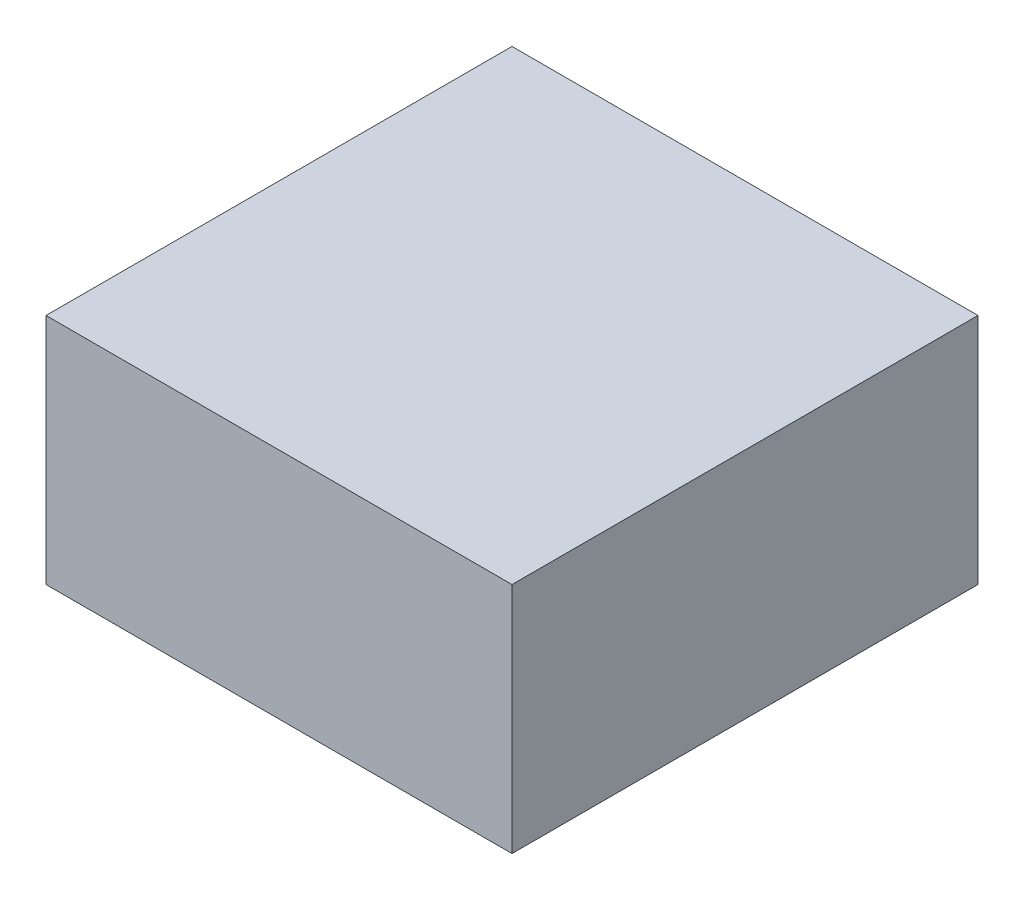
ISO-10303-21;
HEADER;
FILE_DESCRIPTION(('STEP AP214'),'2;1');
FILE_NAME('part.step','',(''),(''),'','','');
FILE_SCHEMA(('AUTOMOTIVE_DESIGN { 1 0 10303 214 1 1 1 1 }'));
ENDSEC;
DATA;
#1=APPLICATION_CONTEXT('core data for automotive mechanical design processes');
#2=APPLICATION_PROTOCOL_DEFINITION('international standard','automotive_design',2000,#1);
#3=PRODUCT_CONTEXT('',#1,'mechanical');
#4=PRODUCT('Part','Part','',(#3));
#5=PRODUCT_RELATED_PRODUCT_CATEGORY('part','',(#4));
#6=PRODUCT_DEFINITION_FORMATION('','',#4);
#7=PRODUCT_DEFINITION_CONTEXT('part definition',#1,'design');
#8=PRODUCT_DEFINITION('design','',#6,#7);
#9=PRODUCT_DEFINITION_SHAPE('','',#8);
#10=(LENGTH_UNIT() NAMED_UNIT(*) SI_UNIT(.MILLI.,.METRE.));
#11=(NAMED_UNIT(*) PLANE_ANGLE_UNIT() SI_UNIT($,.RADIAN.));
#12=(NAMED_UNIT(*) SI_UNIT($,.STERADIAN.) SOLID_ANGLE_UNIT());
#13=UNCERTAINTY_MEASURE_WITH_UNIT(LENGTH_MEASURE(1.E-05),#10,'distance_accuracy_value','');
#14=(GEOMETRIC_REPRESENTATION_CONTEXT(3) GLOBAL_UNCERTAINTY_ASSIGNED_CONTEXT((#13)) GLOBAL_UNIT_ASSIGNED_CONTEXT((#10,
#11,#12)) REPRESENTATION_CONTEXT('',''));
#15=CARTESIAN_POINT('',(0.,0.,0.));
#16=DIRECTION('',(0.,0.,1.));
#17=DIRECTION('',(1.,0.,0.));
#18=AXIS2_PLACEMENT_3D('',#15,#16,#17);
#19=CARTESIAN_POINT('',(0.1,0.1,-0.1));
#20=DIRECTION('',(-1.,0.,0.));
#21=DIRECTION('',(0.,0.,1.));
#22=AXIS2_PLACEMENT_3D('',#19,#20,#21);
#23=PLANE('',#22);
#24=DIRECTION('',(0.,0.,-1.));
#25=VECTOR('',#24,1.);
#26=CARTESIAN_POINT('',(0.1,0.,-0.1));
#27=LINE('',#26,#25);
#28=CARTESIAN_POINT('',(0.1,0.,0.1));
#29=VERTEX_POINT('',#28);
#30=CARTESIAN_POINT('',(0.1,0.,-0.1));
#31=VERTEX_POINT('',#30);
#32=EDGE_CURVE('E96',#29,#31,#27,.T.);
#33=ORIENTED_EDGE('',*,*,#32,.T.);
#34=DIRECTION('',(0.,-1.,0.));
#35=VECTOR('',#34,1.);
#36=CARTESIAN_POINT('',(0.1,0.1,-0.1));
#37=LINE('',#36,#35);
#38=CARTESIAN_POINT('',(0.1,0.1,-0.1));
#39=VERTEX_POINT('',#38);
#40=EDGE_CURVE('E11',#39,#31,#37,.T.);
#41=ORIENTED_EDGE('',*,*,#40,.F.);
#42=DIRECTION('',(0.,0.,-1.));
#43=VECTOR('',#42,1.);
#44=CARTESIAN_POINT('',(0.1,0.1,-0.1));
#45=LINE('',#44,#43);
#46=CARTESIAN_POINT('',(0.1,0.1,0.1));
#47=VERTEX_POINT('',#46);
#48=EDGE_CURVE('E84',#47,#39,#45,.T.);
#49=ORIENTED_EDGE('',*,*,#48,.F.);
#50=DIRECTION('',(0.,-1.,0.));
#51=VECTOR('',#50,1.);
#52=CARTESIAN_POINT('',(0.1,0.1,0.1));
#53=LINE('',#52,#51);
#54=EDGE_CURVE('E92',#47,#29,#53,.T.);
#55=ORIENTED_EDGE('',*,*,#54,.T.);
#56=EDGE_LOOP('',(#33,#41,#49,#55));
#57=FACE_BOUND('',#56,.T.);
#58=ADVANCED_FACE('F33',(#57),#23,.F.);
#59=CARTESIAN_POINT('',(0.1,0.1,-0.1));
#60=DIRECTION('',(0.,0.,1.));
#61=DIRECTION('',(1.,0.,0.));
#62=AXIS2_PLACEMENT_3D('',#59,#60,#61);
#63=PLANE('',#62);
#64=DIRECTION('',(-1.,0.,0.));
#65=VECTOR('',#64,1.);
#66=CARTESIAN_POINT('',(0.1,0.,-0.1));
#67=LINE('',#66,#65);
#68=CARTESIAN_POINT('',(-0.1,0.,-0.1));
#69=VERTEX_POINT('',#68);
#70=EDGE_CURVE('E88',#31,#69,#67,.T.);
#71=ORIENTED_EDGE('',*,*,#70,.T.);
#72=DIRECTION('',(0.,-1.,0.));
#73=VECTOR('',#72,1.);
#74=CARTESIAN_POINT('',(-0.1,0.1,-0.1));
#75=LINE('',#74,#73);
#76=CARTESIAN_POINT('',(-0.1,0.1,-0.1));
#77=VERTEX_POINT('',#76);
#78=EDGE_CURVE('E41',#77,#69,#75,.T.);
#79=ORIENTED_EDGE('',*,*,#78,.F.);
#80=DIRECTION('',(-1.,0.,0.));
#81=VECTOR('',#80,1.);
#82=CARTESIAN_POINT('',(0.1,0.1,-0.1));
#83=LINE('',#82,#81);
#84=EDGE_CURVE('E79',#39,#77,#83,.T.);
#85=ORIENTED_EDGE('',*,*,#84,.F.);
#86=ORIENTED_EDGE('',*,*,#40,.T.);
#87=EDGE_LOOP('',(#71,#79,#85,#86));
#88=FACE_BOUND('',#87,.T.);
#89=ADVANCED_FACE('F87',(#88),#63,.F.);
#90=CARTESIAN_POINT('',(-0.1,0.1,-0.1));
#91=DIRECTION('',(1.,0.,0.));
#92=DIRECTION('',(0.,0.,-1.));
#93=AXIS2_PLACEMENT_3D('',#90,#91,#92);
#94=PLANE('',#93);
#95=DIRECTION('',(0.,0.,1.));
#96=VECTOR('',#95,1.);
#97=CARTESIAN_POINT('',(-0.1,0.,-0.1));
#98=LINE('',#97,#96);
#99=CARTESIAN_POINT('',(-0.1,0.,0.1));
#100=VERTEX_POINT('',#99);
#101=EDGE_CURVE('E66',#69,#100,#98,.T.);
#102=ORIENTED_EDGE('',*,*,#101,.T.);
#103=DIRECTION('',(0.,-1.,0.));
#104=VECTOR('',#103,1.);
#105=CARTESIAN_POINT('',(-0.1,0.1,0.1));
#106=LINE('',#105,#104);
#107=CARTESIAN_POINT('',(-0.1,0.1,0.1));
#108=VERTEX_POINT('',#107);
#109=EDGE_CURVE('E89',#108,#100,#106,.T.);
#110=ORIENTED_EDGE('',*,*,#109,.F.);
#111=DIRECTION('',(0.,0.,1.));
#112=VECTOR('',#111,1.);
#113=CARTESIAN_POINT('',(-0.1,0.1,-0.1));
#114=LINE('',#113,#112);
#115=EDGE_CURVE('E82',#77,#108,#114,.T.);
#116=ORIENTED_EDGE('',*,*,#115,.F.);
#117=ORIENTED_EDGE('',*,*,#78,.T.);
#118=EDGE_LOOP('',(#102,#110,#116,#117));
#119=FACE_BOUND('',#118,.T.);
#120=ADVANCED_FACE('F90',(#119),#94,.F.);
#121=CARTESIAN_POINT('',(0.1,0.1,0.1));
#122=DIRECTION('',(0.,0.,-1.));
#123=DIRECTION('',(-1.,0.,0.));
#124=AXIS2_PLACEMENT_3D('',#121,#122,#123);
#125=PLANE('',#124);
#126=DIRECTION('',(1.,0.,0.));
#127=VECTOR('',#126,1.);
#128=CARTESIAN_POINT('',(0.1,0.,0.1));
#129=LINE('',#128,#127);
#130=EDGE_CURVE('E72',#100,#29,#129,.T.);
#131=ORIENTED_EDGE('',*,*,#130,.T.);
#132=ORIENTED_EDGE('',*,*,#54,.F.);
#133=DIRECTION('',(1.,0.,0.));
#134=VECTOR('',#133,1.);
#135=CARTESIAN_POINT('',(0.1,0.1,0.1));
#136=LINE('',#135,#134);
#137=EDGE_CURVE('E49',#108,#47,#136,.T.);
#138=ORIENTED_EDGE('',*,*,#137,.F.);
#139=ORIENTED_EDGE('',*,*,#109,.T.);
#140=EDGE_LOOP('',(#131,#132,#138,#139));
#141=FACE_BOUND('',#140,.T.);
#142=ADVANCED_FACE('F103',(#141),#125,.F.);
#143=CARTESIAN_POINT('',(0.,0.1,0.));
#144=DIRECTION('',(0.,-1.,0.));
#145=DIRECTION('',(0.,0.,-1.));
#146=AXIS2_PLACEMENT_3D('',#143,#144,#145);
#147=PLANE('',#146);
#148=ORIENTED_EDGE('',*,*,#48,.T.);
#149=ORIENTED_EDGE('',*,*,#84,.T.);
#150=ORIENTED_EDGE('',*,*,#115,.T.);
#151=ORIENTED_EDGE('',*,*,#137,.T.);
#152=EDGE_LOOP('',(#148,#149,#150,#151));
#153=FACE_BOUND('',#152,.T.);
#154=ADVANCED_FACE('F80',(#153),#147,.F.);
#155=CARTESIAN_POINT('',(0.,0.,0.));
#156=DIRECTION('',(0.,-1.,0.));
#157=DIRECTION('',(0.,0.,-1.));
#158=AXIS2_PLACEMENT_3D('',#155,#156,#157);
#159=PLANE('',#158);
#160=ORIENTED_EDGE('',*,*,#32,.F.);
#161=ORIENTED_EDGE('',*,*,#130,.F.);
#162=ORIENTED_EDGE('',*,*,#101,.F.);
#163=ORIENTED_EDGE('',*,*,#70,.F.);
#164=EDGE_LOOP('',(#160,#161,#162,#163));
#165=FACE_BOUND('',#164,.T.);
#166=ADVANCED_FACE('F106',(#165),#159,.T.);
#167=CLOSED_SHELL('',(#58,#89,#120,#142,#154,#166));
#168=MANIFOLD_SOLID_BREP('B2',#167);
#169=ADVANCED_BREP_SHAPE_REPRESENTATION('',(#18,#168),#14);
#170=SHAPE_DEFINITION_REPRESENTATION(#9,#169);
ENDSEC;
END-ISO-10303-21;
